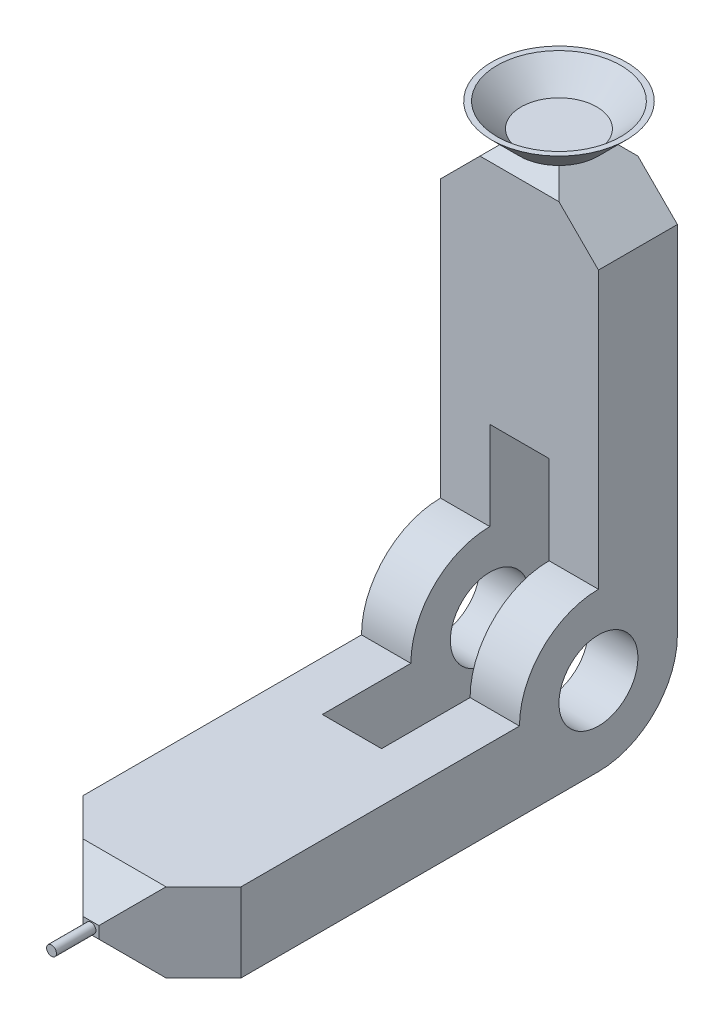
ISO-10303-21;
HEADER;
FILE_DESCRIPTION(('STEP AP214'),'2;1');
FILE_NAME('part.step','',(''),(''),'','','');
FILE_SCHEMA(('AUTOMOTIVE_DESIGN { 1 0 10303 214 1 1 1 1 }'));
ENDSEC;
DATA;
#1=APPLICATION_CONTEXT('core data for automotive mechanical design processes');
#2=APPLICATION_PROTOCOL_DEFINITION('international standard','automotive_design',2000,#1);
#3=PRODUCT_CONTEXT('',#1,'mechanical');
#4=PRODUCT('Part','Part','',(#3));
#5=PRODUCT_RELATED_PRODUCT_CATEGORY('part','',(#4));
#6=PRODUCT_DEFINITION_FORMATION('','',#4);
#7=PRODUCT_DEFINITION_CONTEXT('part definition',#1,'design');
#8=PRODUCT_DEFINITION('design','',#6,#7);
#9=PRODUCT_DEFINITION_SHAPE('','',#8);
#10=(LENGTH_UNIT() NAMED_UNIT(*) SI_UNIT(.MILLI.,.METRE.));
#11=(NAMED_UNIT(*) PLANE_ANGLE_UNIT() SI_UNIT($,.RADIAN.));
#12=(NAMED_UNIT(*) SI_UNIT($,.STERADIAN.) SOLID_ANGLE_UNIT());
#13=UNCERTAINTY_MEASURE_WITH_UNIT(LENGTH_MEASURE(1.E-05),#10,'distance_accuracy_value','');
#14=(GEOMETRIC_REPRESENTATION_CONTEXT(3) GLOBAL_UNCERTAINTY_ASSIGNED_CONTEXT((#13)) GLOBAL_UNIT_ASSIGNED_CONTEXT((#10,
#11,#12)) REPRESENTATION_CONTEXT('',''));
#15=CARTESIAN_POINT('',(0.,0.,0.));
#16=DIRECTION('',(0.,0.,1.));
#17=DIRECTION('',(1.,0.,0.));
#18=AXIS2_PLACEMENT_3D('',#15,#16,#17);
#19=CARTESIAN_POINT('',(20.,0.,0.));
#20=DIRECTION('',(-1.,0.,0.));
#21=DIRECTION('',(0.,0.,1.));
#22=AXIS2_PLACEMENT_3D('',#19,#20,#21);
#23=CYLINDRICAL_SURFACE('',#22,20.);
#24=CARTESIAN_POINT('',(-7.5,0.,0.));
#25=DIRECTION('',(1.,0.,0.));
#26=DIRECTION('',(0.,0.,-1.));
#27=AXIS2_PLACEMENT_3D('',#24,#25,#26);
#28=CIRCLE('',#27,20.);
#29=CARTESIAN_POINT('',(-7.5,-20.,0.));
#30=VERTEX_POINT('',#29);
#31=CARTESIAN_POINT('',(-7.5,0.,-20.));
#32=VERTEX_POINT('',#31);
#33=EDGE_CURVE('E428',#30,#32,#28,.T.);
#34=ORIENTED_EDGE('',*,*,#33,.F.);
#35=DIRECTION('',(-1.,0.,0.));
#36=VECTOR('',#35,1.);
#37=CARTESIAN_POINT('',(20.,-20.,0.));
#38=LINE('',#37,#36);
#39=CARTESIAN_POINT('',(-20.,-20.,0.));
#40=VERTEX_POINT('',#39);
#41=EDGE_CURVE('E344',#30,#40,#38,.T.);
#42=ORIENTED_EDGE('',*,*,#41,.T.);
#43=CARTESIAN_POINT('',(-20.,0.,0.));
#44=DIRECTION('',(1.,0.,0.));
#45=DIRECTION('',(0.,0.,-1.));
#46=AXIS2_PLACEMENT_3D('',#43,#44,#45);
#47=CIRCLE('',#46,20.);
#48=CARTESIAN_POINT('',(-20.,0.,-20.));
#49=VERTEX_POINT('',#48);
#50=EDGE_CURVE('E258',#40,#49,#47,.T.);
#51=ORIENTED_EDGE('',*,*,#50,.T.);
#52=DIRECTION('',(-1.,0.,0.));
#53=VECTOR('',#52,1.);
#54=CARTESIAN_POINT('',(20.,0.,-20.));
#55=LINE('',#54,#53);
#56=EDGE_CURVE('E257',#32,#49,#55,.T.);
#57=ORIENTED_EDGE('',*,*,#56,.F.);
#58=EDGE_LOOP('',(#34,#42,#51,#57));
#59=FACE_BOUND('',#58,.T.);
#60=ADVANCED_FACE('F36',(#59),#23,.T.);
#61=CARTESIAN_POINT('',(20.,0.,-20.));
#62=DIRECTION('',(0.,0.,1.));
#63=DIRECTION('',(1.,0.,0.));
#64=AXIS2_PLACEMENT_3D('',#61,#62,#63);
#65=PLANE('',#64);
#66=DIRECTION('',(0.,1.,0.));
#67=VECTOR('',#66,1.);
#68=CARTESIAN_POINT('',(-20.,0.,-20.));
#69=LINE('',#68,#67);
#70=CARTESIAN_POINT('',(-20.,90.0000000000001,-20.));
#71=VERTEX_POINT('',#70);
#72=EDGE_CURVE('E248',#49,#71,#69,.T.);
#73=ORIENTED_EDGE('',*,*,#72,.T.);
#74=DIRECTION('',(-0.707106781186547,-0.707106781186548,0.));
#75=VECTOR('',#74,1.);
#76=CARTESIAN_POINT('',(-5.00000000000002,105.,-20.));
#77=LINE('',#76,#75);
#78=CARTESIAN_POINT('',(-10.0000000000001,100.,-20.));
#79=VERTEX_POINT('',#78);
#80=EDGE_CURVE('E58',#71,#79,#77,.F.);
#81=ORIENTED_EDGE('',*,*,#80,.T.);
#82=DIRECTION('',(-1.,0.,0.));
#83=VECTOR('',#82,1.);
#84=CARTESIAN_POINT('',(20.,100.,-20.));
#85=LINE('',#84,#83);
#86=CARTESIAN_POINT('',(10.0000000000001,100.,-20.));
#87=VERTEX_POINT('',#86);
#88=EDGE_CURVE('E214',#87,#79,#85,.T.);
#89=ORIENTED_EDGE('',*,*,#88,.F.);
#90=DIRECTION('',(0.707106781186549,-0.707106781186546,0.));
#91=VECTOR('',#90,1.);
#92=CARTESIAN_POINT('',(20.,90.0000000000001,-20.));
#93=LINE('',#92,#91);
#94=CARTESIAN_POINT('',(20.,90.0000000000002,-20.));
#95=VERTEX_POINT('',#94);
#96=EDGE_CURVE('E52',#87,#95,#93,.T.);
#97=ORIENTED_EDGE('',*,*,#96,.T.);
#98=DIRECTION('',(0.,1.,0.));
#99=VECTOR('',#98,1.);
#100=CARTESIAN_POINT('',(20.,0.,-20.));
#101=LINE('',#100,#99);
#102=CARTESIAN_POINT('',(20.,0.,-20.));
#103=VERTEX_POINT('',#102);
#104=EDGE_CURVE('E332',#103,#95,#101,.T.);
#105=ORIENTED_EDGE('',*,*,#104,.F.);
#106=CARTESIAN_POINT('',(7.5,0.,-20.));
#107=VERTEX_POINT('',#106);
#108=EDGE_CURVE('E272',#103,#107,#55,.T.);
#109=ORIENTED_EDGE('',*,*,#108,.T.);
#110=DIRECTION('',(0.,1.,0.));
#111=VECTOR('',#110,1.);
#112=CARTESIAN_POINT('',(7.5,0.,-20.));
#113=LINE('',#112,#111);
#114=CARTESIAN_POINT('',(7.5,42.42,-20.));
#115=VERTEX_POINT('',#114);
#116=EDGE_CURVE('E440',#107,#115,#113,.T.);
#117=ORIENTED_EDGE('',*,*,#116,.T.);
#118=DIRECTION('',(1.,0.,0.));
#119=VECTOR('',#118,1.);
#120=CARTESIAN_POINT('',(-7.5,42.42,-20.));
#121=LINE('',#120,#119);
#122=CARTESIAN_POINT('',(-7.5,42.42,-20.));
#123=VERTEX_POINT('',#122);
#124=EDGE_CURVE('E321',#123,#115,#121,.T.);
#125=ORIENTED_EDGE('',*,*,#124,.F.);
#126=DIRECTION('',(0.,1.,0.));
#127=VECTOR('',#126,1.);
#128=CARTESIAN_POINT('',(-7.5,0.,-20.));
#129=LINE('',#128,#127);
#130=EDGE_CURVE('E457',#32,#123,#129,.T.);
#131=ORIENTED_EDGE('',*,*,#130,.F.);
#132=ORIENTED_EDGE('',*,*,#56,.T.);
#133=EDGE_LOOP('',(#73,#81,#89,#97,#105,#109,#117,#125,#131,#132));
#134=FACE_BOUND('',#133,.T.);
#135=ADVANCED_FACE('F254',(#134),#65,.F.);
#136=CARTESIAN_POINT('',(20.,100.,0.));
#137=DIRECTION('',(0.,0.,-1.));
#138=DIRECTION('',(0.,1.,0.));
#139=AXIS2_PLACEMENT_3D('',#136,#137,#138);
#140=PLANE('',#139);
#141=DIRECTION('',(-1.,0.,0.));
#142=VECTOR('',#141,1.);
#143=CARTESIAN_POINT('',(20.,100.,0.));
#144=LINE('',#143,#142);
#145=CARTESIAN_POINT('',(10.0000000000001,100.,0.));
#146=VERTEX_POINT('',#145);
#147=CARTESIAN_POINT('',(-10.,100.,0.));
#148=VERTEX_POINT('',#147);
#149=EDGE_CURVE('E265',#146,#148,#144,.T.);
#150=ORIENTED_EDGE('',*,*,#149,.T.);
#151=DIRECTION('',(0.707106781186547,0.707106781186548,0.));
#152=VECTOR('',#151,1.);
#153=CARTESIAN_POINT('',(-5.00000000000001,105.,0.));
#154=LINE('',#153,#152);
#155=CARTESIAN_POINT('',(-20.,90.,0.));
#156=VERTEX_POINT('',#155);
#157=EDGE_CURVE('E236',#148,#156,#154,.F.);
#158=ORIENTED_EDGE('',*,*,#157,.T.);
#159=DIRECTION('',(0.,-1.,0.));
#160=VECTOR('',#159,1.);
#161=CARTESIAN_POINT('',(-20.,100.,0.));
#162=LINE('',#161,#160);
#163=CARTESIAN_POINT('',(-20.,20.,0.));
#164=VERTEX_POINT('',#163);
#165=EDGE_CURVE('E251',#156,#164,#162,.T.);
#166=ORIENTED_EDGE('',*,*,#165,.T.);
#167=DIRECTION('',(-1.,0.,0.));
#168=VECTOR('',#167,1.);
#169=CARTESIAN_POINT('',(20.,20.,0.));
#170=LINE('',#169,#168);
#171=CARTESIAN_POINT('',(-7.5,20.,0.));
#172=VERTEX_POINT('',#171);
#173=EDGE_CURVE('E373',#172,#164,#170,.T.);
#174=ORIENTED_EDGE('',*,*,#173,.F.);
#175=DIRECTION('',(0.,-1.,0.));
#176=VECTOR('',#175,1.);
#177=CARTESIAN_POINT('',(-7.5,20.,0.));
#178=LINE('',#177,#176);
#179=CARTESIAN_POINT('',(-7.5,42.42,0.));
#180=VERTEX_POINT('',#179);
#181=EDGE_CURVE('E466',#180,#172,#178,.T.);
#182=ORIENTED_EDGE('',*,*,#181,.F.);
#183=DIRECTION('',(1.,0.,0.));
#184=VECTOR('',#183,1.);
#185=CARTESIAN_POINT('',(-7.5,42.42,0.));
#186=LINE('',#185,#184);
#187=CARTESIAN_POINT('',(7.5,42.42,0.));
#188=VERTEX_POINT('',#187);
#189=EDGE_CURVE('E313',#180,#188,#186,.T.);
#190=ORIENTED_EDGE('',*,*,#189,.T.);
#191=DIRECTION('',(0.,-1.,0.));
#192=VECTOR('',#191,1.);
#193=CARTESIAN_POINT('',(7.5,20.,0.));
#194=LINE('',#193,#192);
#195=CARTESIAN_POINT('',(7.5,20.,0.));
#196=VERTEX_POINT('',#195);
#197=EDGE_CURVE('E447',#188,#196,#194,.T.);
#198=ORIENTED_EDGE('',*,*,#197,.T.);
#199=CARTESIAN_POINT('',(20.,20.,0.));
#200=VERTEX_POINT('',#199);
#201=EDGE_CURVE('E267',#200,#196,#170,.T.);
#202=ORIENTED_EDGE('',*,*,#201,.F.);
#203=DIRECTION('',(0.,-1.,0.));
#204=VECTOR('',#203,1.);
#205=CARTESIAN_POINT('',(20.,100.,0.));
#206=LINE('',#205,#204);
#207=CARTESIAN_POINT('',(20.,90.0000000000001,0.));
#208=VERTEX_POINT('',#207);
#209=EDGE_CURVE('E335',#208,#200,#206,.T.);
#210=ORIENTED_EDGE('',*,*,#209,.F.);
#211=DIRECTION('',(-0.707106781186549,0.707106781186546,0.));
#212=VECTOR('',#211,1.);
#213=CARTESIAN_POINT('',(20.,90.0000000000001,1.2490009027033E-13));
#214=LINE('',#213,#212);
#215=EDGE_CURVE('E234',#208,#146,#214,.T.);
#216=ORIENTED_EDGE('',*,*,#215,.T.);
#217=EDGE_LOOP('',(#150,#158,#166,#174,#182,#190,#198,#202,#210,#216));
#218=FACE_BOUND('',#217,.T.);
#219=ADVANCED_FACE('F489',(#218),#140,.F.);
#220=CARTESIAN_POINT('',(20.,0.,0.));
#221=DIRECTION('',(-1.,0.,0.));
#222=DIRECTION('',(0.,0.,1.));
#223=AXIS2_PLACEMENT_3D('',#220,#221,#222);
#224=CYLINDRICAL_SURFACE('',#223,20.);
#225=CARTESIAN_POINT('',(-7.5,0.,0.));
#226=DIRECTION('',(1.,0.,0.));
#227=DIRECTION('',(0.,0.,-1.));
#228=AXIS2_PLACEMENT_3D('',#225,#226,#227);
#229=CIRCLE('',#228,20.);
#230=CARTESIAN_POINT('',(-7.5,0.,20.));
#231=VERTEX_POINT('',#230);
#232=EDGE_CURVE('E386',#172,#231,#229,.T.);
#233=ORIENTED_EDGE('',*,*,#232,.F.);
#234=ORIENTED_EDGE('',*,*,#173,.T.);
#235=CARTESIAN_POINT('',(-20.,0.,0.));
#236=DIRECTION('',(1.,0.,0.));
#237=DIRECTION('',(0.,0.,-1.));
#238=AXIS2_PLACEMENT_3D('',#235,#236,#237);
#239=CIRCLE('',#238,20.);
#240=CARTESIAN_POINT('',(-20.,0.,20.));
#241=VERTEX_POINT('',#240);
#242=EDGE_CURVE('E347',#164,#241,#239,.T.);
#243=ORIENTED_EDGE('',*,*,#242,.T.);
#244=DIRECTION('',(-1.,0.,0.));
#245=VECTOR('',#244,1.);
#246=CARTESIAN_POINT('',(20.,0.,20.));
#247=LINE('',#246,#245);
#248=EDGE_CURVE('E370',#231,#241,#247,.T.);
#249=ORIENTED_EDGE('',*,*,#248,.F.);
#250=EDGE_LOOP('',(#233,#234,#243,#249));
#251=FACE_BOUND('',#250,.T.);
#252=ADVANCED_FACE('F383',(#251),#224,.T.);
#253=CARTESIAN_POINT('',(20.,0.,100.));
#254=DIRECTION('',(0.,-1.,0.));
#255=DIRECTION('',(0.,0.,-1.));
#256=AXIS2_PLACEMENT_3D('',#253,#254,#255);
#257=PLANE('',#256);
#258=DIRECTION('',(0.,0.,1.));
#259=VECTOR('',#258,1.);
#260=CARTESIAN_POINT('',(-7.5,0.,20.));
#261=LINE('',#260,#259);
#262=CARTESIAN_POINT('',(-7.5,0.,42.42));
#263=VERTEX_POINT('',#262);
#264=EDGE_CURVE('E433',#231,#263,#261,.T.);
#265=ORIENTED_EDGE('',*,*,#264,.F.);
#266=ORIENTED_EDGE('',*,*,#248,.T.);
#267=DIRECTION('',(0.,0.,1.));
#268=VECTOR('',#267,1.);
#269=CARTESIAN_POINT('',(-20.,0.,100.));
#270=LINE('',#269,#268);
#271=CARTESIAN_POINT('',(-20.,0.,90.5));
#272=VERTEX_POINT('',#271);
#273=EDGE_CURVE('E350',#241,#272,#270,.T.);
#274=ORIENTED_EDGE('',*,*,#273,.T.);
#275=DIRECTION('',(-0.707106781186546,0.,-0.707106781186549));
#276=VECTOR('',#275,1.);
#277=CARTESIAN_POINT('',(-2.00000000000001,0.,108.5));
#278=LINE('',#277,#276);
#279=CARTESIAN_POINT('',(-10.5,0.,100.));
#280=VERTEX_POINT('',#279);
#281=EDGE_CURVE('E292',#272,#280,#278,.F.);
#282=ORIENTED_EDGE('',*,*,#281,.T.);
#283=DIRECTION('',(-1.,0.,0.));
#284=VECTOR('',#283,1.);
#285=CARTESIAN_POINT('',(20.,0.,100.));
#286=LINE('',#285,#284);
#287=CARTESIAN_POINT('',(10.5,0.,100.));
#288=VERTEX_POINT('',#287);
#289=EDGE_CURVE('E367',#288,#280,#286,.T.);
#290=ORIENTED_EDGE('',*,*,#289,.F.);
#291=DIRECTION('',(0.707106781186549,0.,-0.707106781186546));
#292=VECTOR('',#291,1.);
#293=CARTESIAN_POINT('',(20.,0.,90.5000000000001));
#294=LINE('',#293,#292);
#295=CARTESIAN_POINT('',(20.,0.,90.5000000000001));
#296=VERTEX_POINT('',#295);
#297=EDGE_CURVE('E290',#288,#296,#294,.T.);
#298=ORIENTED_EDGE('',*,*,#297,.T.);
#299=DIRECTION('',(0.,0.,1.));
#300=VECTOR('',#299,1.);
#301=CARTESIAN_POINT('',(20.,0.,100.));
#302=LINE('',#301,#300);
#303=CARTESIAN_POINT('',(20.,0.,20.));
#304=VERTEX_POINT('',#303);
#305=EDGE_CURVE('E339',#304,#296,#302,.T.);
#306=ORIENTED_EDGE('',*,*,#305,.F.);
#307=CARTESIAN_POINT('',(7.5,0.,20.));
#308=VERTEX_POINT('',#307);
#309=EDGE_CURVE('E371',#304,#308,#247,.T.);
#310=ORIENTED_EDGE('',*,*,#309,.T.);
#311=DIRECTION('',(0.,0.,1.));
#312=VECTOR('',#311,1.);
#313=CARTESIAN_POINT('',(7.5,0.,20.));
#314=LINE('',#313,#312);
#315=CARTESIAN_POINT('',(7.5,0.,42.42));
#316=VERTEX_POINT('',#315);
#317=EDGE_CURVE('E452',#308,#316,#314,.T.);
#318=ORIENTED_EDGE('',*,*,#317,.T.);
#319=DIRECTION('',(1.,0.,0.));
#320=VECTOR('',#319,1.);
#321=CARTESIAN_POINT('',(-7.5,0.,42.42));
#322=LINE('',#321,#320);
#323=EDGE_CURVE('E307',#263,#316,#322,.T.);
#324=ORIENTED_EDGE('',*,*,#323,.F.);
#325=EDGE_LOOP('',(#265,#266,#274,#282,#290,#298,#306,#310,#318,#324));
#326=FACE_BOUND('',#325,.T.);
#327=ADVANCED_FACE('F394',(#326),#257,.F.);
#328=CARTESIAN_POINT('',(20.,-20.,0.));
#329=DIRECTION('',(0.,1.,0.));
#330=DIRECTION('',(0.,0.,1.));
#331=AXIS2_PLACEMENT_3D('',#328,#329,#330);
#332=PLANE('',#331);
#333=DIRECTION('',(0.,0.,-1.));
#334=VECTOR('',#333,1.);
#335=CARTESIAN_POINT('',(-7.5,-20.,42.42));
#336=LINE('',#335,#334);
#337=CARTESIAN_POINT('',(-7.5,-20.,42.42));
#338=VERTEX_POINT('',#337);
#339=EDGE_CURVE('E323',#338,#30,#336,.T.);
#340=ORIENTED_EDGE('',*,*,#339,.F.);
#341=DIRECTION('',(1.,0.,0.));
#342=VECTOR('',#341,1.);
#343=CARTESIAN_POINT('',(-7.5,-20.,42.42));
#344=LINE('',#343,#342);
#345=CARTESIAN_POINT('',(7.5,-20.,42.42));
#346=VERTEX_POINT('',#345);
#347=EDGE_CURVE('E301',#338,#346,#344,.T.);
#348=ORIENTED_EDGE('',*,*,#347,.T.);
#349=DIRECTION('',(0.,0.,-1.));
#350=VECTOR('',#349,1.);
#351=CARTESIAN_POINT('',(7.5,-20.,42.42));
#352=LINE('',#351,#350);
#353=CARTESIAN_POINT('',(7.5,-20.,0.));
#354=VERTEX_POINT('',#353);
#355=EDGE_CURVE('E316',#346,#354,#352,.T.);
#356=ORIENTED_EDGE('',*,*,#355,.T.);
#357=CARTESIAN_POINT('',(20.,-20.,0.));
#358=VERTEX_POINT('',#357);
#359=EDGE_CURVE('E355',#358,#354,#38,.T.);
#360=ORIENTED_EDGE('',*,*,#359,.F.);
#361=DIRECTION('',(0.,0.,-1.));
#362=VECTOR('',#361,1.);
#363=CARTESIAN_POINT('',(20.,-20.,0.));
#364=LINE('',#363,#362);
#365=CARTESIAN_POINT('',(20.,-20.,90.5000000000001));
#366=VERTEX_POINT('',#365);
#367=EDGE_CURVE('E342',#366,#358,#364,.T.);
#368=ORIENTED_EDGE('',*,*,#367,.F.);
#369=DIRECTION('',(-0.707106781186549,0.,0.707106781186546));
#370=VECTOR('',#369,1.);
#371=CARTESIAN_POINT('',(20.,-20.,90.5000000000001));
#372=LINE('',#371,#370);
#373=CARTESIAN_POINT('',(10.5,-20.,100.));
#374=VERTEX_POINT('',#373);
#375=EDGE_CURVE('E284',#366,#374,#372,.T.);
#376=ORIENTED_EDGE('',*,*,#375,.T.);
#377=DIRECTION('',(-1.,0.,0.));
#378=VECTOR('',#377,1.);
#379=CARTESIAN_POINT('',(20.,-20.,100.));
#380=LINE('',#379,#378);
#381=CARTESIAN_POINT('',(-10.5,-20.,100.));
#382=VERTEX_POINT('',#381);
#383=EDGE_CURVE('E358',#374,#382,#380,.T.);
#384=ORIENTED_EDGE('',*,*,#383,.T.);
#385=DIRECTION('',(0.707106781186546,0.,0.707106781186549));
#386=VECTOR('',#385,1.);
#387=CARTESIAN_POINT('',(-2.00000000000001,-20.,108.5));
#388=LINE('',#387,#386);
#389=CARTESIAN_POINT('',(-20.,-20.,90.5));
#390=VERTEX_POINT('',#389);
#391=EDGE_CURVE('E286',#382,#390,#388,.F.);
#392=ORIENTED_EDGE('',*,*,#391,.T.);
#393=DIRECTION('',(0.,0.,-1.));
#394=VECTOR('',#393,1.);
#395=CARTESIAN_POINT('',(-20.,-20.,0.));
#396=LINE('',#395,#394);
#397=EDGE_CURVE('E333',#390,#40,#396,.T.);
#398=ORIENTED_EDGE('',*,*,#397,.T.);
#399=ORIENTED_EDGE('',*,*,#41,.F.);
#400=EDGE_LOOP('',(#340,#348,#356,#360,#368,#376,#384,#392,#398,#399));
#401=FACE_BOUND('',#400,.T.);
#402=ADVANCED_FACE('F421',(#401),#332,.F.);
#403=CARTESIAN_POINT('',(20.,0.,0.));
#404=DIRECTION('',(-1.,0.,0.));
#405=DIRECTION('',(0.,0.,1.));
#406=AXIS2_PLACEMENT_3D('',#403,#404,#405);
#407=CYLINDRICAL_SURFACE('',#406,10.);
#408=CARTESIAN_POINT('',(-20.,0.,0.));
#409=DIRECTION('',(1.,0.,0.));
#410=DIRECTION('',(0.,0.,-1.));
#411=AXIS2_PLACEMENT_3D('',#408,#409,#410);
#412=CIRCLE('',#411,10.);
#413=CARTESIAN_POINT('',(-20.,0.,-10.));
#414=VERTEX_POINT('',#413);
#415=EDGE_CURVE('E305',#414,#414,#412,.T.);
#416=ORIENTED_EDGE('',*,*,#415,.F.);
#417=EDGE_LOOP('',(#416));
#418=FACE_BOUND('',#417,.T.);
#419=CARTESIAN_POINT('',(-7.5,0.,0.));
#420=DIRECTION('',(1.,0.,0.));
#421=DIRECTION('',(0.,0.,-1.));
#422=AXIS2_PLACEMENT_3D('',#419,#420,#421);
#423=CIRCLE('',#422,10.);
#424=CARTESIAN_POINT('',(-7.5,0.,-10.));
#425=VERTEX_POINT('',#424);
#426=EDGE_CURVE('E228',#425,#425,#423,.T.);
#427=ORIENTED_EDGE('',*,*,#426,.T.);
#428=EDGE_LOOP('',(#427));
#429=FACE_BOUND('',#428,.T.);
#430=ADVANCED_FACE('F615',(#418,#429),#407,.F.);
#431=CARTESIAN_POINT('',(20.,0.,0.));
#432=DIRECTION('',(1.,0.,0.));
#433=DIRECTION('',(0.,0.,-1.));
#434=AXIS2_PLACEMENT_3D('',#431,#432,#433);
#435=PLANE('',#434);
#436=ORIENTED_EDGE('',*,*,#104,.T.);
#437=DIRECTION('',(0.,0.,1.));
#438=VECTOR('',#437,1.);
#439=CARTESIAN_POINT('',(20.,90.0000000000001,-5.00000000000001));
#440=LINE('',#439,#438);
#441=EDGE_CURVE('E11',#95,#208,#440,.T.);
#442=ORIENTED_EDGE('',*,*,#441,.T.);
#443=ORIENTED_EDGE('',*,*,#209,.T.);
#444=CARTESIAN_POINT('',(20.,0.,0.));
#445=DIRECTION('',(1.,0.,0.));
#446=DIRECTION('',(0.,0.,-1.));
#447=AXIS2_PLACEMENT_3D('',#444,#445,#446);
#448=CIRCLE('',#447,20.);
#449=EDGE_CURVE('E337',#200,#304,#448,.T.);
#450=ORIENTED_EDGE('',*,*,#449,.T.);
#451=ORIENTED_EDGE('',*,*,#305,.T.);
#452=DIRECTION('',(0.,-1.,0.));
#453=VECTOR('',#452,1.);
#454=CARTESIAN_POINT('',(20.,-11.5,90.5000000000001));
#455=LINE('',#454,#453);
#456=EDGE_CURVE('E225',#296,#366,#455,.T.);
#457=ORIENTED_EDGE('',*,*,#456,.T.);
#458=ORIENTED_EDGE('',*,*,#367,.T.);
#459=CARTESIAN_POINT('',(20.,0.,0.));
#460=DIRECTION('',(1.,0.,0.));
#461=DIRECTION('',(0.,0.,-1.));
#462=AXIS2_PLACEMENT_3D('',#459,#460,#461);
#463=CIRCLE('',#462,20.);
#464=EDGE_CURVE('E329',#358,#103,#463,.T.);
#465=ORIENTED_EDGE('',*,*,#464,.T.);
#466=EDGE_LOOP('',(#436,#442,#443,#450,#451,#457,#458,#465));
#467=FACE_BOUND('',#466,.T.);
#468=CARTESIAN_POINT('',(20.,0.,0.));
#469=DIRECTION('',(1.,0.,0.));
#470=DIRECTION('',(0.,0.,-1.));
#471=AXIS2_PLACEMENT_3D('',#468,#469,#470);
#472=CIRCLE('',#471,10.);
#473=CARTESIAN_POINT('',(20.,0.,-10.));
#474=VERTEX_POINT('',#473);
#475=EDGE_CURVE('E324',#474,#474,#472,.T.);
#476=ORIENTED_EDGE('',*,*,#475,.F.);
#477=EDGE_LOOP('',(#476));
#478=FACE_BOUND('',#477,.T.);
#479=ADVANCED_FACE('F416',(#467,#478),#435,.T.);
#480=CARTESIAN_POINT('',(-20.,0.,0.));
#481=DIRECTION('',(1.,0.,0.));
#482=DIRECTION('',(0.,0.,-1.));
#483=AXIS2_PLACEMENT_3D('',#480,#481,#482);
#484=PLANE('',#483);
#485=ORIENTED_EDGE('',*,*,#165,.F.);
#486=DIRECTION('',(0.,0.,-1.));
#487=VECTOR('',#486,1.);
#488=CARTESIAN_POINT('',(-20.,90.,1.2490009027033E-13));
#489=LINE('',#488,#487);
#490=EDGE_CURVE('E238',#156,#71,#489,.T.);
#491=ORIENTED_EDGE('',*,*,#490,.T.);
#492=ORIENTED_EDGE('',*,*,#72,.F.);
#493=ORIENTED_EDGE('',*,*,#50,.F.);
#494=ORIENTED_EDGE('',*,*,#397,.F.);
#495=DIRECTION('',(0.,1.,0.));
#496=VECTOR('',#495,1.);
#497=CARTESIAN_POINT('',(-20.,0.,90.5));
#498=LINE('',#497,#496);
#499=EDGE_CURVE('E288',#390,#272,#498,.T.);
#500=ORIENTED_EDGE('',*,*,#499,.T.);
#501=ORIENTED_EDGE('',*,*,#273,.F.);
#502=ORIENTED_EDGE('',*,*,#242,.F.);
#503=EDGE_LOOP('',(#485,#491,#492,#493,#494,#500,#501,#502));
#504=FACE_BOUND('',#503,.T.);
#505=ORIENTED_EDGE('',*,*,#415,.T.);
#506=EDGE_LOOP('',(#505));
#507=FACE_BOUND('',#506,.T.);
#508=ADVANCED_FACE('F245',(#504,#507),#484,.F.);
#509=ORIENTED_EDGE('',*,*,#359,.T.);
#510=CARTESIAN_POINT('',(7.5,0.,0.));
#511=DIRECTION('',(1.,0.,0.));
#512=DIRECTION('',(0.,0.,-1.));
#513=AXIS2_PLACEMENT_3D('',#510,#511,#512);
#514=CIRCLE('',#513,20.);
#515=EDGE_CURVE('E437',#354,#107,#514,.T.);
#516=ORIENTED_EDGE('',*,*,#515,.T.);
#517=ORIENTED_EDGE('',*,*,#108,.F.);
#518=ORIENTED_EDGE('',*,*,#464,.F.);
#519=EDGE_LOOP('',(#509,#516,#517,#518));
#520=FACE_BOUND('',#519,.T.);
#521=ADVANCED_FACE('F485',(#520),#23,.T.);
#522=CARTESIAN_POINT('',(20.,105.,-15.));
#523=DIRECTION('',(0.,-0.707106781186544,0.707106781186551));
#524=DIRECTION('',(0.,-0.707106781186551,-0.707106781186544));
#525=AXIS2_PLACEMENT_3D('',#522,#523,#524);
#526=PLANE('',#525);
#527=ORIENTED_EDGE('',*,*,#88,.T.);
#528=DIRECTION('',(-0.577350269189628,-0.577350269189628,-0.577350269189622));
#529=VECTOR('',#528,1.);
#530=CARTESIAN_POINT('',(-1.6666666666667,108.333333333333,-11.6666666666667));
#531=LINE('',#530,#529);
#532=CARTESIAN_POINT('',(-5.00000000000002,105.,-15.));
#533=VERTEX_POINT('',#532);
#534=EDGE_CURVE('E45',#79,#533,#531,.F.);
#535=ORIENTED_EDGE('',*,*,#534,.T.);
#536=DIRECTION('',(-1.,0.,0.));
#537=VECTOR('',#536,1.);
#538=CARTESIAN_POINT('',(20.,105.,-15.));
#539=LINE('',#538,#537);
#540=CARTESIAN_POINT('',(5.00000000000001,105.,-15.));
#541=VERTEX_POINT('',#540);
#542=EDGE_CURVE('E208',#541,#533,#539,.T.);
#543=ORIENTED_EDGE('',*,*,#542,.F.);
#544=DIRECTION('',(0.57735026918963,-0.577350269189627,-0.577350269189621));
#545=VECTOR('',#544,1.);
#546=CARTESIAN_POINT('',(10.0000000000001,100.,-20.));
#547=LINE('',#546,#545);
#548=EDGE_CURVE('E198',#541,#87,#547,.T.);
#549=ORIENTED_EDGE('',*,*,#548,.T.);
#550=EDGE_LOOP('',(#527,#535,#543,#549));
#551=FACE_BOUND('',#550,.T.);
#552=ADVANCED_FACE('F209',(#551),#526,.F.);
#553=CARTESIAN_POINT('',(20.,100.,0.));
#554=DIRECTION('',(0.,-0.707106781186544,-0.707106781186551));
#555=DIRECTION('',(0.,0.707106781186551,-0.707106781186544));
#556=AXIS2_PLACEMENT_3D('',#553,#554,#555);
#557=PLANE('',#556);
#558=DIRECTION('',(-1.,0.,0.));
#559=VECTOR('',#558,1.);
#560=CARTESIAN_POINT('',(20.,105.,-4.99999999999999));
#561=LINE('',#560,#559);
#562=CARTESIAN_POINT('',(5.00000000000001,105.,-4.99999999999999));
#563=VERTEX_POINT('',#562);
#564=CARTESIAN_POINT('',(-5.00000000000002,105.,-4.99999999999999));
#565=VERTEX_POINT('',#564);
#566=EDGE_CURVE('E215',#563,#565,#561,.T.);
#567=ORIENTED_EDGE('',*,*,#566,.T.);
#568=DIRECTION('',(0.577350269189627,0.577350269189628,-0.577350269189622));
#569=VECTOR('',#568,1.);
#570=CARTESIAN_POINT('',(-5.00000000000002,105.,-4.99999999999999));
#571=LINE('',#570,#569);
#572=EDGE_CURVE('E232',#565,#148,#571,.F.);
#573=ORIENTED_EDGE('',*,*,#572,.T.);
#574=ORIENTED_EDGE('',*,*,#149,.F.);
#575=DIRECTION('',(-0.577350269189629,0.577350269189627,-0.577350269189621));
#576=VECTOR('',#575,1.);
#577=CARTESIAN_POINT('',(16.6666666666668,93.3333333333333,6.66666666666662));
#578=LINE('',#577,#576);
#579=EDGE_CURVE('E222',#146,#563,#578,.T.);
#580=ORIENTED_EDGE('',*,*,#579,.T.);
#581=EDGE_LOOP('',(#567,#573,#574,#580));
#582=FACE_BOUND('',#581,.T.);
#583=ADVANCED_FACE('F264',(#582),#557,.F.);
#584=ORIENTED_EDGE('',*,*,#201,.T.);
#585=CARTESIAN_POINT('',(7.5,0.,0.));
#586=DIRECTION('',(1.,0.,0.));
#587=DIRECTION('',(0.,0.,-1.));
#588=AXIS2_PLACEMENT_3D('',#585,#586,#587);
#589=CIRCLE('',#588,20.);
#590=EDGE_CURVE('E450',#196,#308,#589,.T.);
#591=ORIENTED_EDGE('',*,*,#590,.T.);
#592=ORIENTED_EDGE('',*,*,#309,.F.);
#593=ORIENTED_EDGE('',*,*,#449,.F.);
#594=EDGE_LOOP('',(#584,#591,#592,#593));
#595=FACE_BOUND('',#594,.T.);
#596=ADVANCED_FACE('F503',(#595),#224,.T.);
#597=CARTESIAN_POINT('',(20.,0.,100.));
#598=DIRECTION('',(0.,-0.707106781186551,-0.707106781186544));
#599=DIRECTION('',(0.,0.707106781186544,-0.707106781186551));
#600=AXIS2_PLACEMENT_3D('',#597,#598,#599);
#601=PLANE('',#600);
#602=ORIENTED_EDGE('',*,*,#289,.T.);
#603=DIRECTION('',(-0.577350269189626,0.577350269189623,-0.577350269189629));
#604=VECTOR('',#603,1.);
#605=CARTESIAN_POINT('',(-1.00000000000002,-9.49999999999995,109.5));
#606=LINE('',#605,#604);
#607=CARTESIAN_POINT('',(-2.00000000000001,-8.49999999999996,108.5));
#608=VERTEX_POINT('',#607);
#609=EDGE_CURVE('E296',#280,#608,#606,.F.);
#610=ORIENTED_EDGE('',*,*,#609,.T.);
#611=DIRECTION('',(-1.,0.,0.));
#612=VECTOR('',#611,1.);
#613=CARTESIAN_POINT('',(20.,-8.49999999999996,108.5));
#614=LINE('',#613,#612);
#615=CARTESIAN_POINT('',(1.99999999999998,-8.49999999999996,108.5));
#616=VERTEX_POINT('',#615);
#617=EDGE_CURVE('E364',#616,#608,#614,.T.);
#618=ORIENTED_EDGE('',*,*,#617,.F.);
#619=DIRECTION('',(0.577350269189629,0.577350269189621,-0.577350269189627));
#620=VECTOR('',#619,1.);
#621=CARTESIAN_POINT('',(16.8333333333334,6.33333333333326,93.6666666666667));
#622=LINE('',#621,#620);
#623=EDGE_CURVE('E294',#616,#288,#622,.T.);
#624=ORIENTED_EDGE('',*,*,#623,.T.);
#625=EDGE_LOOP('',(#602,#610,#618,#624));
#626=FACE_BOUND('',#625,.T.);
#627=ADVANCED_FACE('F403',(#626),#601,.F.);
#628=CARTESIAN_POINT('',(20.,-11.5,108.5));
#629=DIRECTION('',(0.,0.,-1.));
#630=DIRECTION('',(-1.,0.,0.));
#631=AXIS2_PLACEMENT_3D('',#628,#629,#630);
#632=PLANE('',#631);
#633=CARTESIAN_POINT('',(0.,-9.99999999999996,108.5));
#634=DIRECTION('',(0.,0.,1.));
#635=DIRECTION('',(1.,0.,0.));
#636=AXIS2_PLACEMENT_3D('',#633,#634,#635);
#637=CIRCLE('',#636,1.25);
#638=CARTESIAN_POINT('',(1.24999999999998,-9.99999999999996,108.5));
#639=VERTEX_POINT('',#638);
#640=EDGE_CURVE('E220',#639,#639,#637,.T.);
#641=ORIENTED_EDGE('',*,*,#640,.F.);
#642=EDGE_LOOP('',(#641));
#643=FACE_BOUND('',#642,.T.);
#644=ORIENTED_EDGE('',*,*,#617,.T.);
#645=DIRECTION('',(0.,-1.,0.));
#646=VECTOR('',#645,1.);
#647=CARTESIAN_POINT('',(-2.00000000000001,-11.5,108.5));
#648=LINE('',#647,#646);
#649=CARTESIAN_POINT('',(-2.00000000000001,-11.5,108.5));
#650=VERTEX_POINT('',#649);
#651=EDGE_CURVE('E277',#608,#650,#648,.T.);
#652=ORIENTED_EDGE('',*,*,#651,.T.);
#653=DIRECTION('',(-1.,0.,0.));
#654=VECTOR('',#653,1.);
#655=CARTESIAN_POINT('',(20.,-11.5,108.5));
#656=LINE('',#655,#654);
#657=CARTESIAN_POINT('',(1.99999999999998,-11.5,108.5));
#658=VERTEX_POINT('',#657);
#659=EDGE_CURVE('E361',#658,#650,#656,.T.);
#660=ORIENTED_EDGE('',*,*,#659,.F.);
#661=DIRECTION('',(0.,1.,0.));
#662=VECTOR('',#661,1.);
#663=CARTESIAN_POINT('',(1.99999999999998,-8.49999999999996,108.5));
#664=LINE('',#663,#662);
#665=EDGE_CURVE('E275',#658,#616,#664,.T.);
#666=ORIENTED_EDGE('',*,*,#665,.T.);
#667=EDGE_LOOP('',(#644,#652,#660,#666));
#668=FACE_BOUND('',#667,.T.);
#669=ADVANCED_FACE('F406',(#643,#668),#632,.F.);
#670=CARTESIAN_POINT('',(20.,-20.,100.));
#671=DIRECTION('',(0.,0.707106781186547,-0.707106781186548));
#672=DIRECTION('',(0.,0.707106781186548,0.707106781186547));
#673=AXIS2_PLACEMENT_3D('',#670,#671,#672);
#674=PLANE('',#673);
#675=ORIENTED_EDGE('',*,*,#659,.T.);
#676=DIRECTION('',(0.577350269189624,0.577350269189627,0.577350269189626));
#677=VECTOR('',#676,1.);
#678=CARTESIAN_POINT('',(-2.00000000000001,-11.5,108.5));
#679=LINE('',#678,#677);
#680=EDGE_CURVE('E282',#650,#382,#679,.F.);
#681=ORIENTED_EDGE('',*,*,#680,.T.);
#682=ORIENTED_EDGE('',*,*,#383,.F.);
#683=DIRECTION('',(-0.577350269189627,0.577350269189626,0.577350269189625));
#684=VECTOR('',#683,1.);
#685=CARTESIAN_POINT('',(10.1666666666667,-19.6666666666666,100.333333333333));
#686=LINE('',#685,#684);
#687=EDGE_CURVE('E280',#374,#658,#686,.T.);
#688=ORIENTED_EDGE('',*,*,#687,.T.);
#689=EDGE_LOOP('',(#675,#681,#682,#688));
#690=FACE_BOUND('',#689,.T.);
#691=ADVANCED_FACE('F424',(#690),#674,.F.);
#692=CARTESIAN_POINT('',(7.5,0.,0.));
#693=DIRECTION('',(1.,0.,0.));
#694=DIRECTION('',(0.,0.,-1.));
#695=AXIS2_PLACEMENT_3D('',#692,#693,#694);
#696=CIRCLE('',#695,10.);
#697=CARTESIAN_POINT('',(7.5,0.,-10.));
#698=VERTEX_POINT('',#697);
#699=EDGE_CURVE('E299',#698,#698,#696,.T.);
#700=ORIENTED_EDGE('',*,*,#699,.F.);
#701=EDGE_LOOP('',(#700));
#702=FACE_BOUND('',#701,.T.);
#703=ORIENTED_EDGE('',*,*,#475,.T.);
#704=EDGE_LOOP('',(#703));
#705=FACE_BOUND('',#704,.T.);
#706=ADVANCED_FACE('F567',(#702,#705),#407,.F.);
#707=CARTESIAN_POINT('',(-2.00000000000001,-11.5,108.5));
#708=DIRECTION('',(0.707106781186549,0.,-0.707106781186546));
#709=DIRECTION('',(0.,-1.,0.));
#710=AXIS2_PLACEMENT_3D('',#707,#708,#709);
#711=PLANE('',#710);
#712=ORIENTED_EDGE('',*,*,#281,.F.);
#713=ORIENTED_EDGE('',*,*,#499,.F.);
#714=ORIENTED_EDGE('',*,*,#391,.F.);
#715=ORIENTED_EDGE('',*,*,#680,.F.);
#716=ORIENTED_EDGE('',*,*,#651,.F.);
#717=ORIENTED_EDGE('',*,*,#609,.F.);
#718=EDGE_LOOP('',(#712,#713,#714,#715,#716,#717));
#719=FACE_BOUND('',#718,.T.);
#720=ADVANCED_FACE('F398',(#719),#711,.F.);
#721=CARTESIAN_POINT('',(20.,0.,90.5000000000001));
#722=DIRECTION('',(0.707106781186546,0.,0.707106781186549));
#723=DIRECTION('',(0.,1.,0.));
#724=AXIS2_PLACEMENT_3D('',#721,#722,#723);
#725=PLANE('',#724);
#726=ORIENTED_EDGE('',*,*,#623,.F.);
#727=ORIENTED_EDGE('',*,*,#665,.F.);
#728=ORIENTED_EDGE('',*,*,#687,.F.);
#729=ORIENTED_EDGE('',*,*,#375,.F.);
#730=ORIENTED_EDGE('',*,*,#456,.F.);
#731=ORIENTED_EDGE('',*,*,#297,.F.);
#732=EDGE_LOOP('',(#726,#727,#728,#729,#730,#731));
#733=FACE_BOUND('',#732,.T.);
#734=ADVANCED_FACE('F411',(#733),#725,.T.);
#735=CARTESIAN_POINT('',(-7.5,0.,42.42));
#736=DIRECTION('',(0.,0.,1.));
#737=DIRECTION('',(1.,0.,0.));
#738=AXIS2_PLACEMENT_3D('',#735,#736,#737);
#739=PLANE('',#738);
#740=DIRECTION('',(0.,-1.,0.));
#741=VECTOR('',#740,1.);
#742=CARTESIAN_POINT('',(7.5,0.,42.42));
#743=LINE('',#742,#741);
#744=EDGE_CURVE('E454',#316,#346,#743,.T.);
#745=ORIENTED_EDGE('',*,*,#744,.T.);
#746=ORIENTED_EDGE('',*,*,#347,.F.);
#747=DIRECTION('',(0.,-1.,0.));
#748=VECTOR('',#747,1.);
#749=CARTESIAN_POINT('',(-7.5,0.,42.42));
#750=LINE('',#749,#748);
#751=EDGE_CURVE('E431',#263,#338,#750,.T.);
#752=ORIENTED_EDGE('',*,*,#751,.F.);
#753=ORIENTED_EDGE('',*,*,#323,.T.);
#754=EDGE_LOOP('',(#745,#746,#752,#753));
#755=FACE_BOUND('',#754,.T.);
#756=ADVANCED_FACE('F471',(#755),#739,.F.);
#757=CARTESIAN_POINT('',(-7.5,42.42,0.));
#758=DIRECTION('',(0.,1.,0.));
#759=DIRECTION('',(0.,0.,1.));
#760=AXIS2_PLACEMENT_3D('',#757,#758,#759);
#761=PLANE('',#760);
#762=DIRECTION('',(0.,0.,1.));
#763=VECTOR('',#762,1.);
#764=CARTESIAN_POINT('',(7.5,42.42,0.));
#765=LINE('',#764,#763);
#766=EDGE_CURVE('E444',#115,#188,#765,.T.);
#767=ORIENTED_EDGE('',*,*,#766,.T.);
#768=ORIENTED_EDGE('',*,*,#189,.F.);
#769=DIRECTION('',(0.,0.,1.));
#770=VECTOR('',#769,1.);
#771=CARTESIAN_POINT('',(-7.5,42.42,0.));
#772=LINE('',#771,#770);
#773=EDGE_CURVE('E460',#123,#180,#772,.T.);
#774=ORIENTED_EDGE('',*,*,#773,.F.);
#775=ORIENTED_EDGE('',*,*,#124,.T.);
#776=EDGE_LOOP('',(#767,#768,#774,#775));
#777=FACE_BOUND('',#776,.T.);
#778=ADVANCED_FACE('F473',(#777),#761,.F.);
#779=CARTESIAN_POINT('',(-7.5,0.,0.));
#780=DIRECTION('',(1.,0.,0.));
#781=DIRECTION('',(0.,0.,-1.));
#782=AXIS2_PLACEMENT_3D('',#779,#780,#781);
#783=PLANE('',#782);
#784=ORIENTED_EDGE('',*,*,#426,.F.);
#785=EDGE_LOOP('',(#784));
#786=FACE_BOUND('',#785,.T.);
#787=ORIENTED_EDGE('',*,*,#33,.T.);
#788=ORIENTED_EDGE('',*,*,#130,.T.);
#789=ORIENTED_EDGE('',*,*,#773,.T.);
#790=ORIENTED_EDGE('',*,*,#181,.T.);
#791=ORIENTED_EDGE('',*,*,#232,.T.);
#792=ORIENTED_EDGE('',*,*,#264,.T.);
#793=ORIENTED_EDGE('',*,*,#751,.T.);
#794=ORIENTED_EDGE('',*,*,#339,.T.);
#795=EDGE_LOOP('',(#787,#788,#789,#790,#791,#792,#793,#794));
#796=FACE_BOUND('',#795,.T.);
#797=ADVANCED_FACE('F470',(#786,#796),#783,.T.);
#798=CARTESIAN_POINT('',(7.5,0.,0.));
#799=DIRECTION('',(1.,0.,0.));
#800=DIRECTION('',(0.,0.,-1.));
#801=AXIS2_PLACEMENT_3D('',#798,#799,#800);
#802=PLANE('',#801);
#803=ORIENTED_EDGE('',*,*,#699,.T.);
#804=EDGE_LOOP('',(#803));
#805=FACE_BOUND('',#804,.T.);
#806=ORIENTED_EDGE('',*,*,#515,.F.);
#807=ORIENTED_EDGE('',*,*,#355,.F.);
#808=ORIENTED_EDGE('',*,*,#744,.F.);
#809=ORIENTED_EDGE('',*,*,#317,.F.);
#810=ORIENTED_EDGE('',*,*,#590,.F.);
#811=ORIENTED_EDGE('',*,*,#197,.F.);
#812=ORIENTED_EDGE('',*,*,#766,.F.);
#813=ORIENTED_EDGE('',*,*,#116,.F.);
#814=EDGE_LOOP('',(#806,#807,#808,#809,#810,#811,#812,#813));
#815=FACE_BOUND('',#814,.T.);
#816=ADVANCED_FACE('F505',(#805,#815),#802,.F.);
#817=CARTESIAN_POINT('',(0.,-9.99999999999996,118.5));
#818=DIRECTION('',(0.,0.,-1.));
#819=DIRECTION('',(-1.,0.,0.));
#820=AXIS2_PLACEMENT_3D('',#817,#818,#819);
#821=CYLINDRICAL_SURFACE('',#820,1.25);
#822=CARTESIAN_POINT('',(0.,-9.99999999999996,118.5));
#823=DIRECTION('',(0.,0.,1.));
#824=DIRECTION('',(1.,0.,0.));
#825=AXIS2_PLACEMENT_3D('',#822,#823,#824);
#826=CIRCLE('',#825,1.25);
#827=CARTESIAN_POINT('',(1.24999999999998,-9.99999999999996,118.5));
#828=VERTEX_POINT('',#827);
#829=EDGE_CURVE('E441',#828,#828,#826,.T.);
#830=ORIENTED_EDGE('',*,*,#829,.F.);
#831=EDGE_LOOP('',(#830));
#832=FACE_BOUND('',#831,.T.);
#833=ORIENTED_EDGE('',*,*,#640,.T.);
#834=EDGE_LOOP('',(#833));
#835=FACE_BOUND('',#834,.T.);
#836=ADVANCED_FACE('F509',(#832,#835),#821,.T.);
#837=CARTESIAN_POINT('',(0.,-9.99999999999996,118.5));
#838=DIRECTION('',(0.,0.,1.));
#839=DIRECTION('',(1.,0.,0.));
#840=AXIS2_PLACEMENT_3D('',#837,#838,#839);
#841=PLANE('',#840);
#842=ORIENTED_EDGE('',*,*,#829,.T.);
#843=EDGE_LOOP('',(#842));
#844=FACE_BOUND('',#843,.T.);
#845=ADVANCED_FACE('F514',(#844),#841,.T.);
#846=CARTESIAN_POINT('',(-5.00000000000002,105.,-4.99999999999999));
#847=DIRECTION('',(0.707106781186548,-0.707106781186547,0.));
#848=DIRECTION('',(0.,0.,1.));
#849=AXIS2_PLACEMENT_3D('',#846,#847,#848);
#850=PLANE('',#849);
#851=ORIENTED_EDGE('',*,*,#80,.F.);
#852=ORIENTED_EDGE('',*,*,#490,.F.);
#853=ORIENTED_EDGE('',*,*,#157,.F.);
#854=ORIENTED_EDGE('',*,*,#572,.F.);
#855=DIRECTION('',(0.,0.,1.));
#856=VECTOR('',#855,1.);
#857=CARTESIAN_POINT('',(-5.00000000000002,105.,-4.99999999999999));
#858=LINE('',#857,#856);
#859=EDGE_CURVE('E219',#533,#565,#858,.T.);
#860=ORIENTED_EDGE('',*,*,#859,.F.);
#861=ORIENTED_EDGE('',*,*,#534,.F.);
#862=EDGE_LOOP('',(#851,#852,#853,#854,#860,#861));
#863=FACE_BOUND('',#862,.T.);
#864=ADVANCED_FACE('F260',(#863),#850,.F.);
#865=CARTESIAN_POINT('',(20.,90.0000000000001,1.2490009027033E-13));
#866=DIRECTION('',(0.707106781186546,0.707106781186549,0.));
#867=DIRECTION('',(0.,0.,-1.));
#868=AXIS2_PLACEMENT_3D('',#865,#866,#867);
#869=PLANE('',#868);
#870=ORIENTED_EDGE('',*,*,#548,.F.);
#871=DIRECTION('',(0.,0.,-1.));
#872=VECTOR('',#871,1.);
#873=CARTESIAN_POINT('',(5.00000000000001,105.,-15.));
#874=LINE('',#873,#872);
#875=EDGE_CURVE('E202',#563,#541,#874,.T.);
#876=ORIENTED_EDGE('',*,*,#875,.F.);
#877=ORIENTED_EDGE('',*,*,#579,.F.);
#878=ORIENTED_EDGE('',*,*,#215,.F.);
#879=ORIENTED_EDGE('',*,*,#441,.F.);
#880=ORIENTED_EDGE('',*,*,#96,.F.);
#881=EDGE_LOOP('',(#870,#876,#877,#878,#879,#880));
#882=FACE_BOUND('',#881,.T.);
#883=ADVANCED_FACE('F39',(#882),#869,.T.);
#884=CARTESIAN_POINT('',(0.,105.,-10.));
#885=DIRECTION('',(0.,1.,0.));
#886=DIRECTION('',(0.,0.,1.));
#887=AXIS2_PLACEMENT_3D('',#884,#885,#886);
#888=PLANE('',#887);
#889=CARTESIAN_POINT('',(0.,105.,-9.99999999999999));
#890=DIRECTION('',(0.,1.,0.));
#891=DIRECTION('',(0.,0.,1.));
#892=AXIS2_PLACEMENT_3D('',#889,#890,#891);
#893=CIRCLE('',#892,10.);
#894=CARTESIAN_POINT('',(0.,105.,0.));
#895=VERTEX_POINT('',#894);
#896=EDGE_CURVE('E554',#895,#895,#893,.T.);
#897=ORIENTED_EDGE('',*,*,#896,.F.);
#898=EDGE_LOOP('',(#897));
#899=FACE_BOUND('',#898,.T.);
#900=ORIENTED_EDGE('',*,*,#875,.T.);
#901=ORIENTED_EDGE('',*,*,#542,.T.);
#902=ORIENTED_EDGE('',*,*,#859,.T.);
#903=ORIENTED_EDGE('',*,*,#566,.F.);
#904=EDGE_LOOP('',(#900,#901,#902,#903));
#905=FACE_BOUND('',#904,.T.);
#906=ADVANCED_FACE('F217',(#899,#905),#888,.F.);
#907=CARTESIAN_POINT('',(0.,105.,-9.99999999999999));
#908=DIRECTION('',(0.,1.,0.));
#909=DIRECTION('',(0.,0.,1.));
#910=AXIS2_PLACEMENT_3D('',#907,#908,#909);
#911=CONICAL_SURFACE('',#910,10.,0.785398163397446);
#912=CARTESIAN_POINT('',(0.,112.071067811866,-9.99999999999999));
#913=DIRECTION('',(0.,1.,0.));
#914=DIRECTION('',(0.,0.,1.));
#915=AXIS2_PLACEMENT_3D('',#912,#913,#914);
#916=CIRCLE('',#915,17.0710678118655);
#917=CARTESIAN_POINT('',(0.,112.071067811866,7.07106781186547));
#918=VERTEX_POINT('',#917);
#919=EDGE_CURVE('E549',#918,#918,#916,.T.);
#920=ORIENTED_EDGE('',*,*,#919,.F.);
#921=EDGE_LOOP('',(#920));
#922=FACE_BOUND('',#921,.T.);
#923=ORIENTED_EDGE('',*,*,#896,.T.);
#924=EDGE_LOOP('',(#923));
#925=FACE_BOUND('',#924,.T.);
#926=ADVANCED_FACE('F525',(#922,#925),#911,.T.);
#927=CARTESIAN_POINT('',(-17.0710678118655,112.071067811866,-10.));
#928=DIRECTION('',(0.,-1.,0.));
#929=DIRECTION('',(0.,0.,-1.));
#930=AXIS2_PLACEMENT_3D('',#927,#928,#929);
#931=PLANE('',#930);
#932=CARTESIAN_POINT('',(0.,112.071067811866,-9.99999999999999));
#933=DIRECTION('',(0.,1.,0.));
#934=DIRECTION('',(0.,0.,1.));
#935=AXIS2_PLACEMENT_3D('',#932,#933,#934);
#936=CIRCLE('',#935,15.6568542494924);
#937=CARTESIAN_POINT('',(0.,112.071067811866,5.65685424949236));
#938=VERTEX_POINT('',#937);
#939=EDGE_CURVE('E546',#938,#938,#936,.T.);
#940=ORIENTED_EDGE('',*,*,#939,.F.);
#941=EDGE_LOOP('',(#940));
#942=FACE_BOUND('',#941,.T.);
#943=ORIENTED_EDGE('',*,*,#919,.T.);
#944=EDGE_LOOP('',(#943));
#945=FACE_BOUND('',#944,.T.);
#946=ADVANCED_FACE('F529',(#942,#945),#931,.F.);
#947=CARTESIAN_POINT('',(0.,112.071067811866,-9.99999999999999));
#948=DIRECTION('',(0.,1.,0.));
#949=DIRECTION('',(0.,0.,1.));
#950=AXIS2_PLACEMENT_3D('',#947,#948,#949);
#951=CONICAL_SURFACE('',#950,15.6568542494924,0.785398163397447);
#952=CARTESIAN_POINT('',(0.,106.,-9.99999999999999));
#953=DIRECTION('',(0.,1.,0.));
#954=DIRECTION('',(0.,0.,1.));
#955=AXIS2_PLACEMENT_3D('',#952,#953,#954);
#956=CIRCLE('',#955,9.58578643762691);
#957=CARTESIAN_POINT('',(0.,106.,-0.414213562373079));
#958=VERTEX_POINT('',#957);
#959=EDGE_CURVE('E545',#958,#958,#956,.T.);
#960=ORIENTED_EDGE('',*,*,#959,.F.);
#961=EDGE_LOOP('',(#960));
#962=FACE_BOUND('',#961,.T.);
#963=ORIENTED_EDGE('',*,*,#939,.T.);
#964=EDGE_LOOP('',(#963));
#965=FACE_BOUND('',#964,.T.);
#966=ADVANCED_FACE('F533',(#962,#965),#951,.F.);
#967=CARTESIAN_POINT('',(-9.58578643762691,106.,-10.));
#968=DIRECTION('',(0.,-1.,0.));
#969=DIRECTION('',(0.,0.,-1.));
#970=AXIS2_PLACEMENT_3D('',#967,#968,#969);
#971=PLANE('',#970);
#972=ORIENTED_EDGE('',*,*,#959,.T.);
#973=EDGE_LOOP('',(#972));
#974=FACE_BOUND('',#973,.T.);
#975=ADVANCED_FACE('F537',(#974),#971,.F.);
#976=CLOSED_SHELL('',(#60,#135,#219,#252,#327,#402,#430,#479,#508,#521,#552,#583,#596,#627,#669,
#691,#706,#720,#734,#756,#778,#797,#816,#836,#845,#864,#883,#906,#926,#946,#966,#975));
#977=MANIFOLD_SOLID_BREP('B2',#976);
#978=ADVANCED_BREP_SHAPE_REPRESENTATION('',(#18,#977),#14);
#979=SHAPE_DEFINITION_REPRESENTATION(#9,#978);
ENDSEC;
END-ISO-10303-21;
